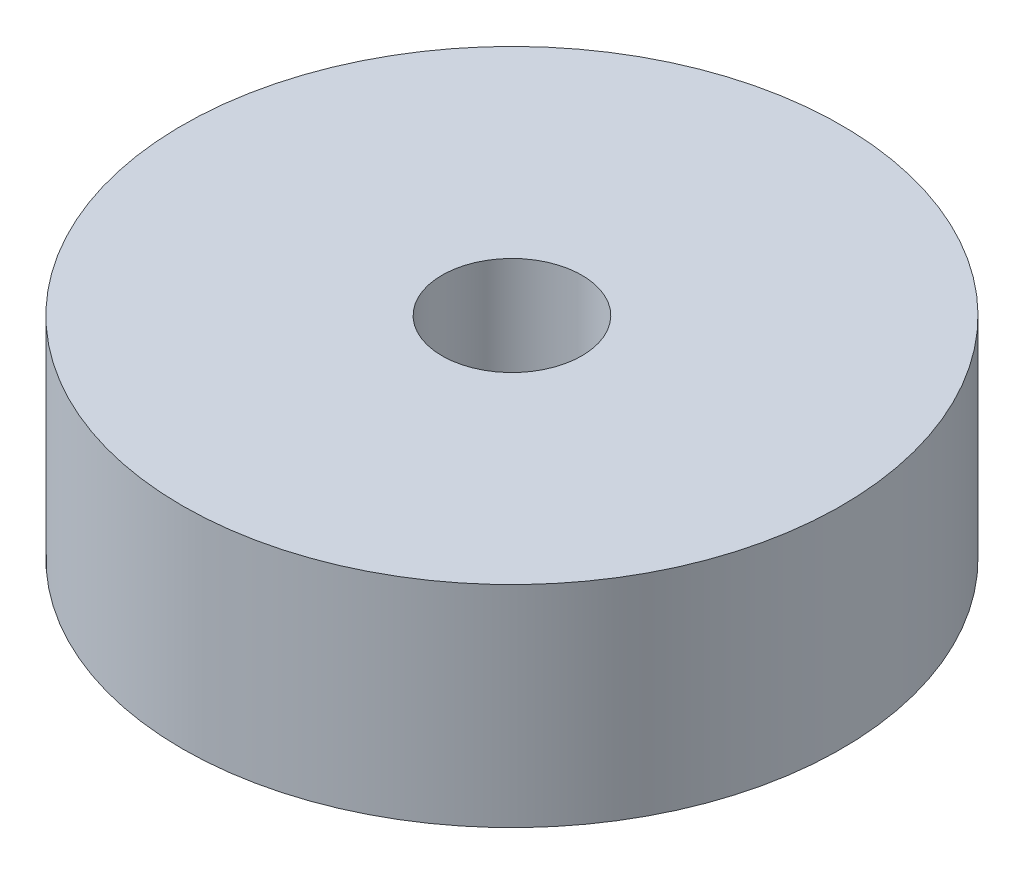
ISO-10303-21;
HEADER;
FILE_DESCRIPTION(('STEP AP214'),'2;1');
FILE_NAME('part.step','',(''),(''),'','','');
FILE_SCHEMA(('AUTOMOTIVE_DESIGN { 1 0 10303 214 1 1 1 1 }'));
ENDSEC;
DATA;
#1=APPLICATION_CONTEXT('core data for automotive mechanical design processes');
#2=APPLICATION_PROTOCOL_DEFINITION('international standard','automotive_design',2000,#1);
#3=PRODUCT_CONTEXT('',#1,'mechanical');
#4=PRODUCT('Part','Part','',(#3));
#5=PRODUCT_RELATED_PRODUCT_CATEGORY('part','',(#4));
#6=PRODUCT_DEFINITION_FORMATION('','',#4);
#7=PRODUCT_DEFINITION_CONTEXT('part definition',#1,'design');
#8=PRODUCT_DEFINITION('design','',#6,#7);
#9=PRODUCT_DEFINITION_SHAPE('','',#8);
#10=(LENGTH_UNIT() NAMED_UNIT(*) SI_UNIT(.MILLI.,.METRE.));
#11=(NAMED_UNIT(*) PLANE_ANGLE_UNIT() SI_UNIT($,.RADIAN.));
#12=(NAMED_UNIT(*) SI_UNIT($,.STERADIAN.) SOLID_ANGLE_UNIT());
#13=UNCERTAINTY_MEASURE_WITH_UNIT(LENGTH_MEASURE(1.E-05),#10,'distance_accuracy_value','');
#14=(GEOMETRIC_REPRESENTATION_CONTEXT(3) GLOBAL_UNCERTAINTY_ASSIGNED_CONTEXT((#13)) GLOBAL_UNIT_ASSIGNED_CONTEXT((#10,
#11,#12)) REPRESENTATION_CONTEXT('',''));
#15=CARTESIAN_POINT('',(0.,0.,0.));
#16=DIRECTION('',(0.,0.,1.));
#17=DIRECTION('',(1.,0.,0.));
#18=AXIS2_PLACEMENT_3D('',#15,#16,#17);
#19=CARTESIAN_POINT('',(0.,111.795002930309,0.));
#20=DIRECTION('',(0.,1.,0.));
#21=DIRECTION('',(0.,0.,1.));
#22=AXIS2_PLACEMENT_3D('',#19,#20,#21);
#23=CYLINDRICAL_SURFACE('',#22,3.4);
#24=CARTESIAN_POINT('',(0.,109.587896149122,0.));
#25=DIRECTION('',(0.,1.,0.));
#26=DIRECTION('',(0.,0.,1.));
#27=AXIS2_PLACEMENT_3D('',#24,#25,#26);
#28=CIRCLE('',#27,3.4);
#29=CARTESIAN_POINT('',(0.,109.587896149122,3.4));
#30=VERTEX_POINT('',#29);
#31=EDGE_CURVE('E59',#30,#30,#28,.T.);
#32=ORIENTED_EDGE('',*,*,#31,.T.);
#33=EDGE_LOOP('',(#32));
#34=FACE_BOUND('',#33,.T.);
#35=CARTESIAN_POINT('',(0.,99.3509380037681,0.));
#36=DIRECTION('',(0.,1.,0.));
#37=DIRECTION('',(0.,0.,1.));
#38=AXIS2_PLACEMENT_3D('',#35,#36,#37);
#39=CIRCLE('',#38,3.4);
#40=CARTESIAN_POINT('',(0.,99.3509380037681,3.4));
#41=VERTEX_POINT('',#40);
#42=EDGE_CURVE('E10',#41,#41,#39,.T.);
#43=ORIENTED_EDGE('',*,*,#42,.F.);
#44=EDGE_LOOP('',(#43));
#45=FACE_BOUND('',#44,.T.);
#46=ADVANCED_FACE('F45',(#34,#45),#23,.F.);
#47=CARTESIAN_POINT('',(-3.4,99.3509380037681,0.));
#48=DIRECTION('',(0.,-1.,0.));
#49=DIRECTION('',(0.,0.,-1.));
#50=AXIS2_PLACEMENT_3D('',#47,#48,#49);
#51=PLANE('',#50);
#52=ORIENTED_EDGE('',*,*,#42,.T.);
#53=EDGE_LOOP('',(#52));
#54=FACE_BOUND('',#53,.T.);
#55=CARTESIAN_POINT('',(0.,99.3509380037681,0.));
#56=DIRECTION('',(0.,1.,0.));
#57=DIRECTION('',(0.,0.,1.));
#58=AXIS2_PLACEMENT_3D('',#55,#56,#57);
#59=CIRCLE('',#58,16.0271117400694);
#60=CARTESIAN_POINT('',(0.,99.3509380037681,16.0271117400694));
#61=VERTEX_POINT('',#60);
#62=EDGE_CURVE('E51',#61,#61,#59,.T.);
#63=ORIENTED_EDGE('',*,*,#62,.F.);
#64=EDGE_LOOP('',(#63));
#65=FACE_BOUND('',#64,.T.);
#66=ADVANCED_FACE('F75',(#54,#65),#51,.T.);
#67=CARTESIAN_POINT('',(0.,111.795002930309,0.));
#68=DIRECTION('',(0.,1.,0.));
#69=DIRECTION('',(0.,0.,1.));
#70=AXIS2_PLACEMENT_3D('',#67,#68,#69);
#71=CYLINDRICAL_SURFACE('',#70,16.0271117400694);
#72=ORIENTED_EDGE('',*,*,#62,.T.);
#73=EDGE_LOOP('',(#72));
#74=FACE_BOUND('',#73,.T.);
#75=CARTESIAN_POINT('',(0.,109.587896149122,0.));
#76=DIRECTION('',(0.,1.,0.));
#77=DIRECTION('',(0.,0.,1.));
#78=AXIS2_PLACEMENT_3D('',#75,#76,#77);
#79=CIRCLE('',#78,16.0271117400694);
#80=CARTESIAN_POINT('',(0.,109.587896149122,16.0271117400694));
#81=VERTEX_POINT('',#80);
#82=EDGE_CURVE('E55',#81,#81,#79,.T.);
#83=ORIENTED_EDGE('',*,*,#82,.F.);
#84=EDGE_LOOP('',(#83));
#85=FACE_BOUND('',#84,.T.);
#86=ADVANCED_FACE('F69',(#74,#85),#71,.T.);
#87=CARTESIAN_POINT('',(-3.4,109.587896149122,0.));
#88=DIRECTION('',(0.,1.,0.));
#89=DIRECTION('',(0.,0.,1.));
#90=AXIS2_PLACEMENT_3D('',#87,#88,#89);
#91=PLANE('',#90);
#92=ORIENTED_EDGE('',*,*,#82,.T.);
#93=EDGE_LOOP('',(#92));
#94=FACE_BOUND('',#93,.T.);
#95=ORIENTED_EDGE('',*,*,#31,.F.);
#96=EDGE_LOOP('',(#95));
#97=FACE_BOUND('',#96,.T.);
#98=ADVANCED_FACE('F67',(#94,#97),#91,.T.);
#99=CLOSED_SHELL('',(#46,#66,#86,#98));
#100=MANIFOLD_SOLID_BREP('B2',#99);
#101=ADVANCED_BREP_SHAPE_REPRESENTATION('',(#18,#100),#14);
#102=SHAPE_DEFINITION_REPRESENTATION(#9,#101);
ENDSEC;
END-ISO-10303-21;
